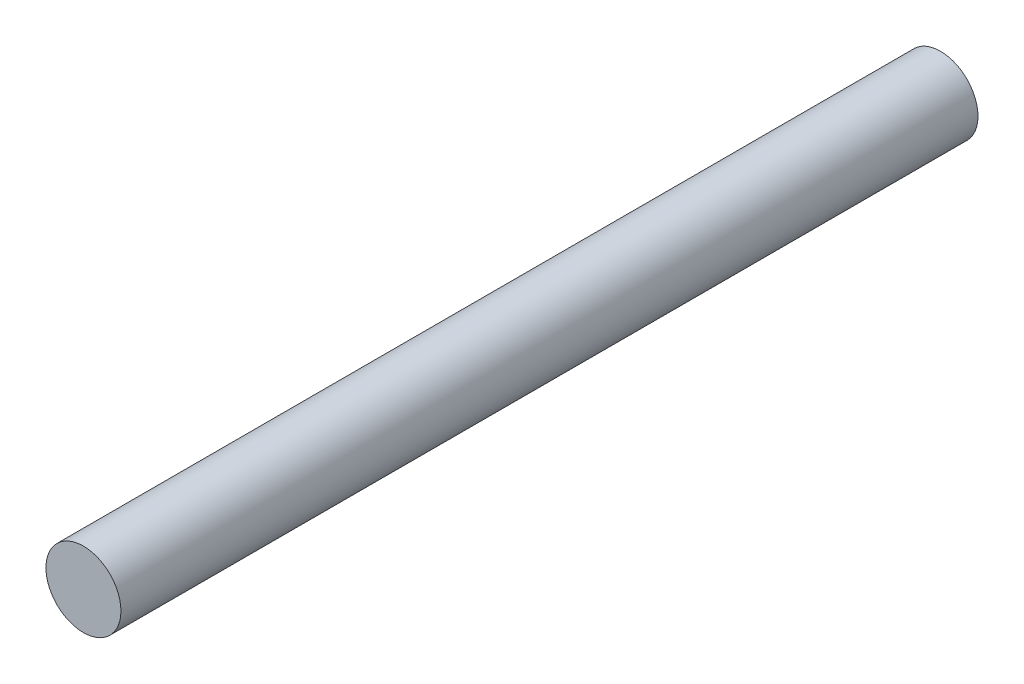
ISO-10303-21;
HEADER;
FILE_DESCRIPTION(('STEP AP214'),'2;1');
FILE_NAME('part.step','',(''),(''),'','','');
FILE_SCHEMA(('AUTOMOTIVE_DESIGN { 1 0 10303 214 1 1 1 1 }'));
ENDSEC;
DATA;
#1=APPLICATION_CONTEXT('core data for automotive mechanical design processes');
#2=APPLICATION_PROTOCOL_DEFINITION('international standard','automotive_design',2000,#1);
#3=PRODUCT_CONTEXT('',#1,'mechanical');
#4=PRODUCT('Part','Part','',(#3));
#5=PRODUCT_RELATED_PRODUCT_CATEGORY('part','',(#4));
#6=PRODUCT_DEFINITION_FORMATION('','',#4);
#7=PRODUCT_DEFINITION_CONTEXT('part definition',#1,'design');
#8=PRODUCT_DEFINITION('design','',#6,#7);
#9=PRODUCT_DEFINITION_SHAPE('','',#8);
#10=(LENGTH_UNIT() NAMED_UNIT(*) SI_UNIT(.MILLI.,.METRE.));
#11=(NAMED_UNIT(*) PLANE_ANGLE_UNIT() SI_UNIT($,.RADIAN.));
#12=(NAMED_UNIT(*) SI_UNIT($,.STERADIAN.) SOLID_ANGLE_UNIT());
#13=UNCERTAINTY_MEASURE_WITH_UNIT(LENGTH_MEASURE(1.E-05),#10,'distance_accuracy_value','');
#14=(GEOMETRIC_REPRESENTATION_CONTEXT(3) GLOBAL_UNCERTAINTY_ASSIGNED_CONTEXT((#13)) GLOBAL_UNIT_ASSIGNED_CONTEXT((#10,
#11,#12)) REPRESENTATION_CONTEXT('',''));
#15=CARTESIAN_POINT('',(0.,0.,0.));
#16=DIRECTION('',(0.,0.,1.));
#17=DIRECTION('',(1.,0.,0.));
#18=AXIS2_PLACEMENT_3D('',#15,#16,#17);
#19=CARTESIAN_POINT('',(0.,4.44089209850063E-13,40.));
#20=DIRECTION('',(0.,0.,-0.999999999999997));
#21=DIRECTION('',(-1.,0.,0.));
#22=AXIS2_PLACEMENT_3D('',#19,#20,#21);
#23=CYLINDRICAL_SURFACE('',#22,1.75);
#24=CARTESIAN_POINT('',(0.,4.44089209850063E-13,40.));
#25=DIRECTION('',(0.,0.,0.999999999999997));
#26=DIRECTION('',(1.,0.,0.));
#27=AXIS2_PLACEMENT_3D('',#24,#25,#26);
#28=CIRCLE('',#27,1.75);
#29=CARTESIAN_POINT('',(1.75,4.44574932423336E-13,40.));
#30=VERTEX_POINT('',#29);
#31=EDGE_CURVE('E10',#30,#30,#28,.T.);
#32=ORIENTED_EDGE('',*,*,#31,.F.);
#33=EDGE_LOOP('',(#32));
#34=FACE_BOUND('',#33,.T.);
#35=CARTESIAN_POINT('',(0.,0.,0.));
#36=DIRECTION('',(0.,0.,0.999999999999997));
#37=DIRECTION('',(1.,0.,0.));
#38=AXIS2_PLACEMENT_3D('',#35,#36,#37);
#39=CIRCLE('',#38,1.75);
#40=CARTESIAN_POINT('',(1.75,0.,0.));
#41=VERTEX_POINT('',#40);
#42=EDGE_CURVE('E35',#41,#41,#39,.T.);
#43=ORIENTED_EDGE('',*,*,#42,.T.);
#44=EDGE_LOOP('',(#43));
#45=FACE_BOUND('',#44,.T.);
#46=ADVANCED_FACE('F32',(#34,#45),#23,.T.);
#47=CARTESIAN_POINT('',(0.,4.44089209850063E-13,40.));
#48=DIRECTION('',(0.,0.,0.999999999999997));
#49=DIRECTION('',(1.,0.,0.));
#50=AXIS2_PLACEMENT_3D('',#47,#48,#49);
#51=PLANE('',#50);
#52=ORIENTED_EDGE('',*,*,#31,.T.);
#53=EDGE_LOOP('',(#52));
#54=FACE_BOUND('',#53,.T.);
#55=ADVANCED_FACE('F47',(#54),#51,.T.);
#56=CARTESIAN_POINT('',(0.,0.,0.));
#57=DIRECTION('',(0.,0.,0.999999999999997));
#58=DIRECTION('',(1.,0.,0.));
#59=AXIS2_PLACEMENT_3D('',#56,#57,#58);
#60=PLANE('',#59);
#61=ORIENTED_EDGE('',*,*,#42,.F.);
#62=EDGE_LOOP('',(#61));
#63=FACE_BOUND('',#62,.T.);
#64=ADVANCED_FACE('F45',(#63),#60,.F.);
#65=CLOSED_SHELL('',(#46,#55,#64));
#66=MANIFOLD_SOLID_BREP('B2',#65);
#67=ADVANCED_BREP_SHAPE_REPRESENTATION('',(#18,#66),#14);
#68=SHAPE_DEFINITION_REPRESENTATION(#9,#67);
ENDSEC;
END-ISO-10303-21;
